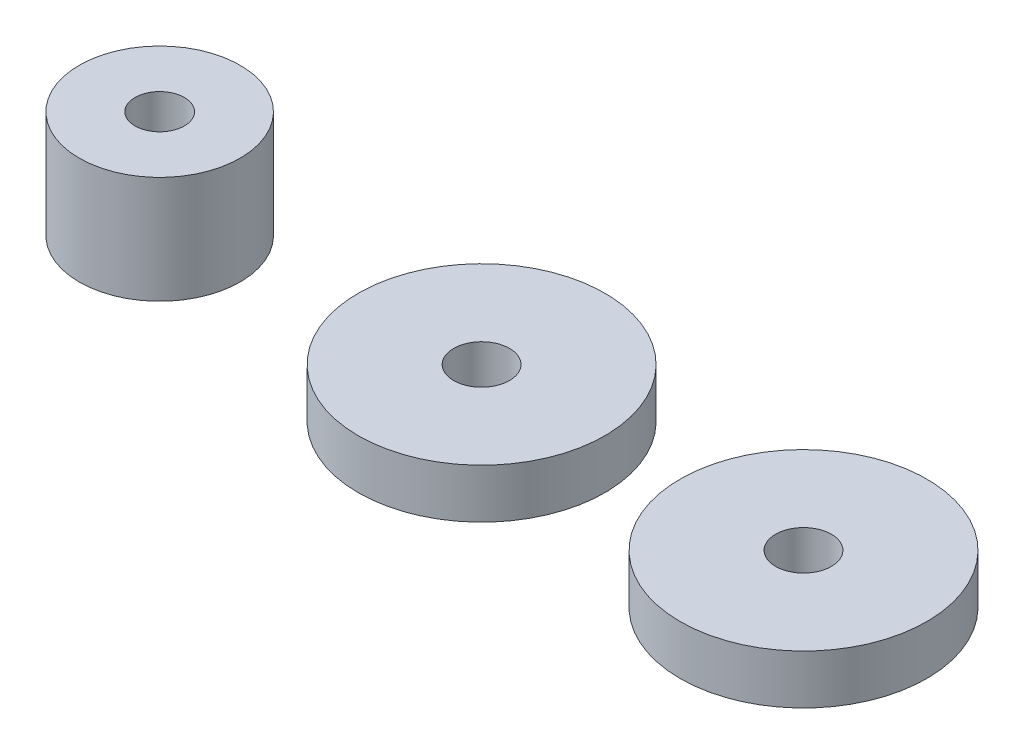
ISO-10303-21;
HEADER;
FILE_DESCRIPTION(('STEP AP214'),'2;1');
FILE_NAME('part.step','',(''),(''),'','','');
FILE_SCHEMA(('AUTOMOTIVE_DESIGN { 1 0 10303 214 1 1 1 1 }'));
ENDSEC;
DATA;
#1=APPLICATION_CONTEXT('core data for automotive mechanical design processes');
#2=APPLICATION_PROTOCOL_DEFINITION('international standard','automotive_design',2000,#1);
#3=PRODUCT_CONTEXT('',#1,'mechanical');
#4=PRODUCT('Part','Part','',(#3));
#5=PRODUCT_RELATED_PRODUCT_CATEGORY('part','',(#4));
#6=PRODUCT_DEFINITION_FORMATION('','',#4);
#7=PRODUCT_DEFINITION_CONTEXT('part definition',#1,'design');
#8=PRODUCT_DEFINITION('design','',#6,#7);
#9=PRODUCT_DEFINITION_SHAPE('','',#8);
#10=(LENGTH_UNIT() NAMED_UNIT(*) SI_UNIT(.MILLI.,.METRE.));
#11=(NAMED_UNIT(*) PLANE_ANGLE_UNIT() SI_UNIT($,.RADIAN.));
#12=(NAMED_UNIT(*) SI_UNIT($,.STERADIAN.) SOLID_ANGLE_UNIT());
#13=UNCERTAINTY_MEASURE_WITH_UNIT(LENGTH_MEASURE(1.E-05),#10,'distance_accuracy_value','');
#14=(GEOMETRIC_REPRESENTATION_CONTEXT(3) GLOBAL_UNCERTAINTY_ASSIGNED_CONTEXT((#13)) GLOBAL_UNIT_ASSIGNED_CONTEXT((#10,
#11,#12)) REPRESENTATION_CONTEXT('',''));
#15=CARTESIAN_POINT('',(0.,0.,0.));
#16=DIRECTION('',(0.,0.,1.));
#17=DIRECTION('',(1.,0.,0.));
#18=AXIS2_PLACEMENT_3D('',#15,#16,#17);
#19=CARTESIAN_POINT('',(30.,2.3,0.));
#20=DIRECTION('',(0.,1.,0.));
#21=DIRECTION('',(0.,0.,1.));
#22=AXIS2_PLACEMENT_3D('',#19,#20,#21);
#23=PLANE('',#22);
#24=CARTESIAN_POINT('',(30.,2.3,0.));
#25=DIRECTION('',(0.,1.,0.));
#26=DIRECTION('',(0.,0.,1.));
#27=AXIS2_PLACEMENT_3D('',#24,#25,#26);
#28=CIRCLE('',#27,5.75);
#29=CARTESIAN_POINT('',(30.,2.3,5.75));
#30=VERTEX_POINT('',#29);
#31=EDGE_CURVE('E11',#30,#30,#28,.T.);
#32=ORIENTED_EDGE('',*,*,#31,.T.);
#33=EDGE_LOOP('',(#32));
#34=FACE_BOUND('',#33,.T.);
#35=CARTESIAN_POINT('',(30.,2.3,0.));
#36=DIRECTION('',(0.,1.,0.));
#37=DIRECTION('',(0.,0.,1.));
#38=AXIS2_PLACEMENT_3D('',#35,#36,#37);
#39=CIRCLE('',#38,1.29999999999999);
#40=CARTESIAN_POINT('',(30.,2.3,1.29999999999999));
#41=VERTEX_POINT('',#40);
#42=EDGE_CURVE('E63',#41,#41,#39,.T.);
#43=ORIENTED_EDGE('',*,*,#42,.F.);
#44=EDGE_LOOP('',(#43));
#45=FACE_BOUND('',#44,.T.);
#46=ADVANCED_FACE('F50',(#34,#45),#23,.T.);
#47=CARTESIAN_POINT('',(30.,0.,0.));
#48=DIRECTION('',(0.,1.,0.));
#49=DIRECTION('',(0.,0.,1.));
#50=AXIS2_PLACEMENT_3D('',#47,#48,#49);
#51=PLANE('',#50);
#52=CARTESIAN_POINT('',(30.,0.,0.));
#53=DIRECTION('',(0.,1.,0.));
#54=DIRECTION('',(0.,0.,1.));
#55=AXIS2_PLACEMENT_3D('',#52,#53,#54);
#56=CIRCLE('',#55,5.75);
#57=CARTESIAN_POINT('',(30.,0.,5.75));
#58=VERTEX_POINT('',#57);
#59=EDGE_CURVE('E54',#58,#58,#56,.T.);
#60=ORIENTED_EDGE('',*,*,#59,.F.);
#61=EDGE_LOOP('',(#60));
#62=FACE_BOUND('',#61,.T.);
#63=CARTESIAN_POINT('',(30.,0.,0.));
#64=DIRECTION('',(0.,1.,0.));
#65=DIRECTION('',(0.,0.,1.));
#66=AXIS2_PLACEMENT_3D('',#63,#64,#65);
#67=CIRCLE('',#66,1.29999999999999);
#68=CARTESIAN_POINT('',(30.,0.,1.29999999999999));
#69=VERTEX_POINT('',#68);
#70=EDGE_CURVE('E65',#69,#69,#67,.T.);
#71=ORIENTED_EDGE('',*,*,#70,.T.);
#72=EDGE_LOOP('',(#71));
#73=FACE_BOUND('',#72,.T.);
#74=ADVANCED_FACE('F77',(#62,#73),#51,.F.);
#75=CARTESIAN_POINT('',(30.,2.3,0.));
#76=DIRECTION('',(0.,-1.,0.));
#77=DIRECTION('',(0.,0.,-1.));
#78=AXIS2_PLACEMENT_3D('',#75,#76,#77);
#79=CYLINDRICAL_SURFACE('',#78,5.75);
#80=ORIENTED_EDGE('',*,*,#31,.F.);
#81=EDGE_LOOP('',(#80));
#82=FACE_BOUND('',#81,.T.);
#83=ORIENTED_EDGE('',*,*,#59,.T.);
#84=EDGE_LOOP('',(#83));
#85=FACE_BOUND('',#84,.T.);
#86=ADVANCED_FACE('F52',(#82,#85),#79,.T.);
#87=CARTESIAN_POINT('',(30.,2.3,0.));
#88=DIRECTION('',(0.,-1.,0.));
#89=DIRECTION('',(0.,0.,-1.));
#90=AXIS2_PLACEMENT_3D('',#87,#88,#89);
#91=CYLINDRICAL_SURFACE('',#90,1.29999999999999);
#92=ORIENTED_EDGE('',*,*,#42,.T.);
#93=EDGE_LOOP('',(#92));
#94=FACE_BOUND('',#93,.T.);
#95=ORIENTED_EDGE('',*,*,#70,.F.);
#96=EDGE_LOOP('',(#95));
#97=FACE_BOUND('',#96,.T.);
#98=ADVANCED_FACE('F73',(#94,#97),#91,.F.);
#99=CLOSED_SHELL('',(#46,#74,#86,#98));
#100=MANIFOLD_SOLID_BREP('B2',#99);
#101=CARTESIAN_POINT('',(15.,2.3,0.));
#102=DIRECTION('',(0.,1.,0.));
#103=DIRECTION('',(0.,0.,1.));
#104=AXIS2_PLACEMENT_3D('',#101,#102,#103);
#105=PLANE('',#104);
#106=CARTESIAN_POINT('',(15.,2.3,0.));
#107=DIRECTION('',(0.,1.,0.));
#108=DIRECTION('',(0.,0.,1.));
#109=AXIS2_PLACEMENT_3D('',#106,#107,#108);
#110=CIRCLE('',#109,5.75);
#111=CARTESIAN_POINT('',(15.,2.3,5.75));
#112=VERTEX_POINT('',#111);
#113=EDGE_CURVE('E49',#112,#112,#110,.T.);
#114=ORIENTED_EDGE('',*,*,#113,.T.);
#115=EDGE_LOOP('',(#114));
#116=FACE_BOUND('',#115,.T.);
#117=CARTESIAN_POINT('',(15.,2.3,0.));
#118=DIRECTION('',(0.,1.,0.));
#119=DIRECTION('',(0.,0.,1.));
#120=AXIS2_PLACEMENT_3D('',#117,#118,#119);
#121=CIRCLE('',#120,1.3);
#122=CARTESIAN_POINT('',(15.,2.3,1.3));
#123=VERTEX_POINT('',#122);
#124=EDGE_CURVE('E136',#123,#123,#121,.T.);
#125=ORIENTED_EDGE('',*,*,#124,.F.);
#126=EDGE_LOOP('',(#125));
#127=FACE_BOUND('',#126,.T.);
#128=ADVANCED_FACE('F125',(#116,#127),#105,.T.);
#129=CARTESIAN_POINT('',(15.,0.,0.));
#130=DIRECTION('',(0.,1.,0.));
#131=DIRECTION('',(0.,0.,1.));
#132=AXIS2_PLACEMENT_3D('',#129,#130,#131);
#133=PLANE('',#132);
#134=CARTESIAN_POINT('',(15.,0.,0.));
#135=DIRECTION('',(0.,1.,0.));
#136=DIRECTION('',(0.,0.,1.));
#137=AXIS2_PLACEMENT_3D('',#134,#135,#136);
#138=CIRCLE('',#137,5.75);
#139=CARTESIAN_POINT('',(15.,0.,5.75));
#140=VERTEX_POINT('',#139);
#141=EDGE_CURVE('E129',#140,#140,#138,.T.);
#142=ORIENTED_EDGE('',*,*,#141,.F.);
#143=EDGE_LOOP('',(#142));
#144=FACE_BOUND('',#143,.T.);
#145=CARTESIAN_POINT('',(15.,0.,0.));
#146=DIRECTION('',(0.,1.,0.));
#147=DIRECTION('',(0.,0.,1.));
#148=AXIS2_PLACEMENT_3D('',#145,#146,#147);
#149=CIRCLE('',#148,1.3);
#150=CARTESIAN_POINT('',(15.,0.,1.3));
#151=VERTEX_POINT('',#150);
#152=EDGE_CURVE('E138',#151,#151,#149,.T.);
#153=ORIENTED_EDGE('',*,*,#152,.T.);
#154=EDGE_LOOP('',(#153));
#155=FACE_BOUND('',#154,.T.);
#156=ADVANCED_FACE('F148',(#144,#155),#133,.F.);
#157=CARTESIAN_POINT('',(15.,2.3,0.));
#158=DIRECTION('',(0.,-1.,0.));
#159=DIRECTION('',(0.,0.,-1.));
#160=AXIS2_PLACEMENT_3D('',#157,#158,#159);
#161=CYLINDRICAL_SURFACE('',#160,5.75);
#162=ORIENTED_EDGE('',*,*,#113,.F.);
#163=EDGE_LOOP('',(#162));
#164=FACE_BOUND('',#163,.T.);
#165=ORIENTED_EDGE('',*,*,#141,.T.);
#166=EDGE_LOOP('',(#165));
#167=FACE_BOUND('',#166,.T.);
#168=ADVANCED_FACE('F127',(#164,#167),#161,.T.);
#169=CARTESIAN_POINT('',(15.,2.3,0.));
#170=DIRECTION('',(0.,-1.,0.));
#171=DIRECTION('',(0.,0.,-1.));
#172=AXIS2_PLACEMENT_3D('',#169,#170,#171);
#173=CYLINDRICAL_SURFACE('',#172,1.3);
#174=ORIENTED_EDGE('',*,*,#124,.T.);
#175=EDGE_LOOP('',(#174));
#176=FACE_BOUND('',#175,.T.);
#177=ORIENTED_EDGE('',*,*,#152,.F.);
#178=EDGE_LOOP('',(#177));
#179=FACE_BOUND('',#178,.T.);
#180=ADVANCED_FACE('F144',(#176,#179),#173,.F.);
#181=CLOSED_SHELL('',(#128,#156,#168,#180));
#182=MANIFOLD_SOLID_BREP('B6',#181);
#183=CARTESIAN_POINT('',(0.,5.,0.));
#184=DIRECTION('',(0.,1.,0.));
#185=DIRECTION('',(0.,0.,1.));
#186=AXIS2_PLACEMENT_3D('',#183,#184,#185);
#187=PLANE('',#186);
#188=CARTESIAN_POINT('',(0.,5.,0.));
#189=DIRECTION('',(0.,1.,0.));
#190=DIRECTION('',(0.,0.,1.));
#191=AXIS2_PLACEMENT_3D('',#188,#189,#190);
#192=CIRCLE('',#191,3.75);
#193=CARTESIAN_POINT('',(0.,5.,3.75));
#194=VERTEX_POINT('',#193);
#195=EDGE_CURVE('E124',#194,#194,#192,.T.);
#196=ORIENTED_EDGE('',*,*,#195,.T.);
#197=EDGE_LOOP('',(#196));
#198=FACE_BOUND('',#197,.T.);
#199=CARTESIAN_POINT('',(0.,5.,0.));
#200=DIRECTION('',(0.,1.,0.));
#201=DIRECTION('',(0.,0.,1.));
#202=AXIS2_PLACEMENT_3D('',#199,#200,#201);
#203=CIRCLE('',#202,1.15);
#204=CARTESIAN_POINT('',(0.,5.,1.15));
#205=VERTEX_POINT('',#204);
#206=EDGE_CURVE('E200',#205,#205,#203,.T.);
#207=ORIENTED_EDGE('',*,*,#206,.F.);
#208=EDGE_LOOP('',(#207));
#209=FACE_BOUND('',#208,.T.);
#210=ADVANCED_FACE('F189',(#198,#209),#187,.T.);
#211=CARTESIAN_POINT('',(0.,0.,0.));
#212=DIRECTION('',(0.,1.,0.));
#213=DIRECTION('',(0.,0.,1.));
#214=AXIS2_PLACEMENT_3D('',#211,#212,#213);
#215=PLANE('',#214);
#216=CARTESIAN_POINT('',(0.,0.,0.));
#217=DIRECTION('',(0.,1.,0.));
#218=DIRECTION('',(0.,0.,1.));
#219=AXIS2_PLACEMENT_3D('',#216,#217,#218);
#220=CIRCLE('',#219,3.75);
#221=CARTESIAN_POINT('',(0.,0.,3.75));
#222=VERTEX_POINT('',#221);
#223=EDGE_CURVE('E193',#222,#222,#220,.T.);
#224=ORIENTED_EDGE('',*,*,#223,.F.);
#225=EDGE_LOOP('',(#224));
#226=FACE_BOUND('',#225,.T.);
#227=CARTESIAN_POINT('',(0.,0.,0.));
#228=DIRECTION('',(0.,1.,0.));
#229=DIRECTION('',(0.,0.,1.));
#230=AXIS2_PLACEMENT_3D('',#227,#228,#229);
#231=CIRCLE('',#230,1.15);
#232=CARTESIAN_POINT('',(0.,0.,1.15));
#233=VERTEX_POINT('',#232);
#234=EDGE_CURVE('E202',#233,#233,#231,.T.);
#235=ORIENTED_EDGE('',*,*,#234,.T.);
#236=EDGE_LOOP('',(#235));
#237=FACE_BOUND('',#236,.T.);
#238=ADVANCED_FACE('F212',(#226,#237),#215,.F.);
#239=CARTESIAN_POINT('',(0.,5.,0.));
#240=DIRECTION('',(0.,-1.,0.));
#241=DIRECTION('',(0.,0.,-1.));
#242=AXIS2_PLACEMENT_3D('',#239,#240,#241);
#243=CYLINDRICAL_SURFACE('',#242,3.75);
#244=ORIENTED_EDGE('',*,*,#195,.F.);
#245=EDGE_LOOP('',(#244));
#246=FACE_BOUND('',#245,.T.);
#247=ORIENTED_EDGE('',*,*,#223,.T.);
#248=EDGE_LOOP('',(#247));
#249=FACE_BOUND('',#248,.T.);
#250=ADVANCED_FACE('F191',(#246,#249),#243,.T.);
#251=CARTESIAN_POINT('',(0.,5.,0.));
#252=DIRECTION('',(0.,-1.,0.));
#253=DIRECTION('',(0.,0.,-1.));
#254=AXIS2_PLACEMENT_3D('',#251,#252,#253);
#255=CYLINDRICAL_SURFACE('',#254,1.15);
#256=ORIENTED_EDGE('',*,*,#206,.T.);
#257=EDGE_LOOP('',(#256));
#258=FACE_BOUND('',#257,.T.);
#259=ORIENTED_EDGE('',*,*,#234,.F.);
#260=EDGE_LOOP('',(#259));
#261=FACE_BOUND('',#260,.T.);
#262=ADVANCED_FACE('F208',(#258,#261),#255,.F.);
#263=CLOSED_SHELL('',(#210,#238,#250,#262));
#264=MANIFOLD_SOLID_BREP('B44',#263);
#265=ADVANCED_BREP_SHAPE_REPRESENTATION('',(#18,#100,#182,#264),#14);
#266=SHAPE_DEFINITION_REPRESENTATION(#9,#265);
ENDSEC;
END-ISO-10303-21;
